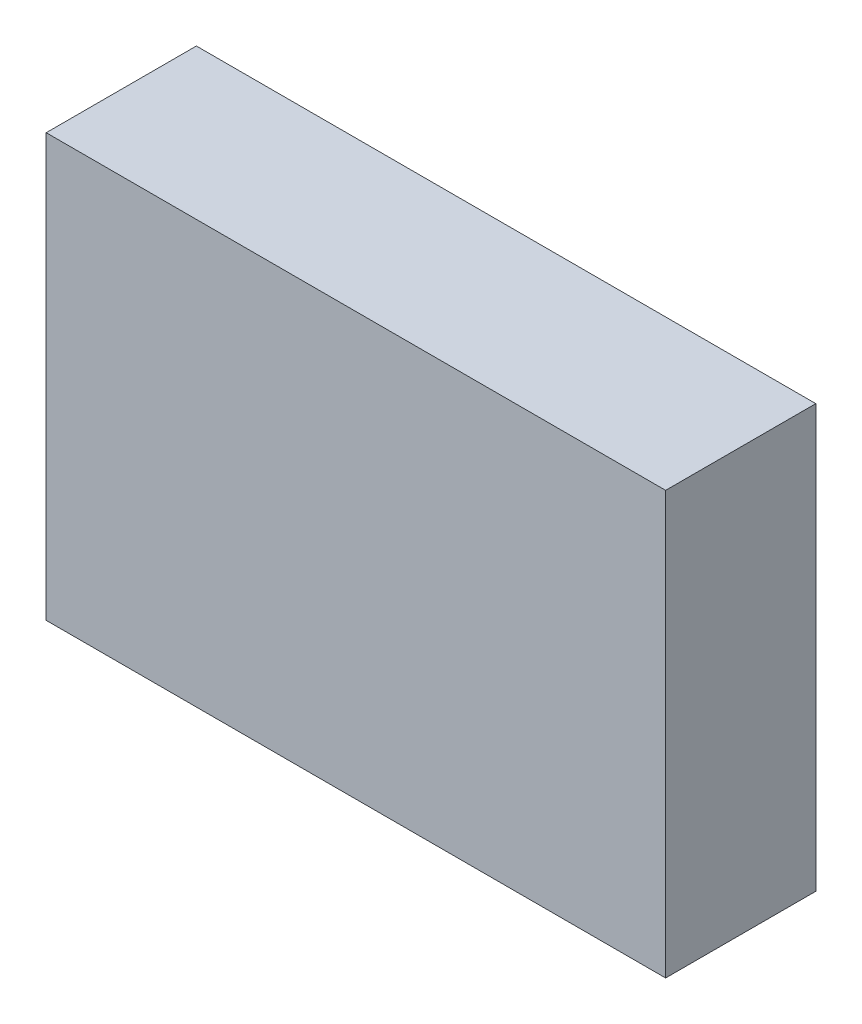
ISO-10303-21;
HEADER;
FILE_DESCRIPTION(('STEP AP214'),'2;1');
FILE_NAME('part.step','',(''),(''),'','','');
FILE_SCHEMA(('AUTOMOTIVE_DESIGN { 1 0 10303 214 1 1 1 1 }'));
ENDSEC;
DATA;
#1=APPLICATION_CONTEXT('core data for automotive mechanical design processes');
#2=APPLICATION_PROTOCOL_DEFINITION('international standard','automotive_design',2000,#1);
#3=PRODUCT_CONTEXT('',#1,'mechanical');
#4=PRODUCT('Part','Part','',(#3));
#5=PRODUCT_RELATED_PRODUCT_CATEGORY('part','',(#4));
#6=PRODUCT_DEFINITION_FORMATION('','',#4);
#7=PRODUCT_DEFINITION_CONTEXT('part definition',#1,'design');
#8=PRODUCT_DEFINITION('design','',#6,#7);
#9=PRODUCT_DEFINITION_SHAPE('','',#8);
#10=(LENGTH_UNIT() NAMED_UNIT(*) SI_UNIT(.MILLI.,.METRE.));
#11=(NAMED_UNIT(*) PLANE_ANGLE_UNIT() SI_UNIT($,.RADIAN.));
#12=(NAMED_UNIT(*) SI_UNIT($,.STERADIAN.) SOLID_ANGLE_UNIT());
#13=UNCERTAINTY_MEASURE_WITH_UNIT(LENGTH_MEASURE(1.E-05),#10,'distance_accuracy_value','');
#14=(GEOMETRIC_REPRESENTATION_CONTEXT(3) GLOBAL_UNCERTAINTY_ASSIGNED_CONTEXT((#13)) GLOBAL_UNIT_ASSIGNED_CONTEXT((#10,
#11,#12)) REPRESENTATION_CONTEXT('',''));
#15=CARTESIAN_POINT('',(0.,0.,0.));
#16=DIRECTION('',(0.,0.,1.));
#17=DIRECTION('',(1.,0.,0.));
#18=AXIS2_PLACEMENT_3D('',#15,#16,#17);
#19=CARTESIAN_POINT('',(0.06,0.,0.06));
#20=DIRECTION('',(1.,0.,0.));
#21=DIRECTION('',(0.,0.,1.));
#22=AXIS2_PLACEMENT_3D('',#19,#20,#21);
#23=PLANE('',#22);
#24=DIRECTION('',(0.,1.,0.));
#25=VECTOR('',#24,1.);
#26=CARTESIAN_POINT('',(0.06,0.,0.54));
#27=LINE('',#26,#25);
#28=CARTESIAN_POINT('',(0.06,0.,0.54));
#29=VERTEX_POINT('',#28);
#30=CARTESIAN_POINT('',(0.06,1.35,0.54));
#31=VERTEX_POINT('',#30);
#32=EDGE_CURVE('E11',#29,#31,#27,.T.);
#33=ORIENTED_EDGE('',*,*,#32,.T.);
#34=DIRECTION('',(0.,0.,1.));
#35=VECTOR('',#34,1.);
#36=CARTESIAN_POINT('',(0.06,1.35,0.06));
#37=LINE('',#36,#35);
#38=CARTESIAN_POINT('',(0.06,1.35,0.06));
#39=VERTEX_POINT('',#38);
#40=EDGE_CURVE('E69',#39,#31,#37,.T.);
#41=ORIENTED_EDGE('',*,*,#40,.F.);
#42=DIRECTION('',(0.,1.,0.));
#43=VECTOR('',#42,1.);
#44=CARTESIAN_POINT('',(0.06,0.,0.06));
#45=LINE('',#44,#43);
#46=CARTESIAN_POINT('',(0.06,0.,0.06));
#47=VERTEX_POINT('',#46);
#48=EDGE_CURVE('E81',#47,#39,#45,.T.);
#49=ORIENTED_EDGE('',*,*,#48,.F.);
#50=DIRECTION('',(0.,0.,1.));
#51=VECTOR('',#50,1.);
#52=CARTESIAN_POINT('',(0.06,0.,0.06));
#53=LINE('',#52,#51);
#54=EDGE_CURVE('E64',#47,#29,#53,.T.);
#55=ORIENTED_EDGE('',*,*,#54,.T.);
#56=EDGE_LOOP('',(#33,#41,#49,#55));
#57=FACE_BOUND('',#56,.T.);
#58=ADVANCED_FACE('F17',(#57),#23,.F.);
#59=CARTESIAN_POINT('',(2.04,0.,0.06));
#60=DIRECTION('',(1.,0.,0.));
#61=DIRECTION('',(0.,0.,1.));
#62=AXIS2_PLACEMENT_3D('',#59,#60,#61);
#63=PLANE('',#62);
#64=DIRECTION('',(0.,0.,1.));
#65=VECTOR('',#64,1.);
#66=CARTESIAN_POINT('',(2.04,0.,0.06));
#67=LINE('',#66,#65);
#68=CARTESIAN_POINT('',(2.04,0.,0.06));
#69=VERTEX_POINT('',#68);
#70=CARTESIAN_POINT('',(2.04,0.,0.54));
#71=VERTEX_POINT('',#70);
#72=EDGE_CURVE('E24',#69,#71,#67,.T.);
#73=ORIENTED_EDGE('',*,*,#72,.F.);
#74=DIRECTION('',(0.,1.,0.));
#75=VECTOR('',#74,1.);
#76=CARTESIAN_POINT('',(2.04,0.,0.06));
#77=LINE('',#76,#75);
#78=CARTESIAN_POINT('',(2.04,1.35,0.06));
#79=VERTEX_POINT('',#78);
#80=EDGE_CURVE('E59',#69,#79,#77,.T.);
#81=ORIENTED_EDGE('',*,*,#80,.T.);
#82=DIRECTION('',(0.,0.,1.));
#83=VECTOR('',#82,1.);
#84=CARTESIAN_POINT('',(2.04,1.35,0.06));
#85=LINE('',#84,#83);
#86=CARTESIAN_POINT('',(2.04,1.35,0.54));
#87=VERTEX_POINT('',#86);
#88=EDGE_CURVE('E53',#79,#87,#85,.T.);
#89=ORIENTED_EDGE('',*,*,#88,.T.);
#90=DIRECTION('',(0.,1.,0.));
#91=VECTOR('',#90,1.);
#92=CARTESIAN_POINT('',(2.04,0.,0.54));
#93=LINE('',#92,#91);
#94=EDGE_CURVE('E57',#71,#87,#93,.T.);
#95=ORIENTED_EDGE('',*,*,#94,.F.);
#96=EDGE_LOOP('',(#73,#81,#89,#95));
#97=FACE_BOUND('',#96,.T.);
#98=ADVANCED_FACE('F55',(#97),#63,.T.);
#99=CARTESIAN_POINT('',(0.06,0.,0.06));
#100=DIRECTION('',(0.,1.,0.));
#101=DIRECTION('',(0.,0.,1.));
#102=AXIS2_PLACEMENT_3D('',#99,#100,#101);
#103=PLANE('',#102);
#104=ORIENTED_EDGE('',*,*,#72,.T.);
#105=DIRECTION('',(1.,0.,0.));
#106=VECTOR('',#105,1.);
#107=CARTESIAN_POINT('',(0.06,0.,0.54));
#108=LINE('',#107,#106);
#109=EDGE_CURVE('E63',#29,#71,#108,.T.);
#110=ORIENTED_EDGE('',*,*,#109,.F.);
#111=ORIENTED_EDGE('',*,*,#54,.F.);
#112=DIRECTION('',(1.,0.,0.));
#113=VECTOR('',#112,1.);
#114=CARTESIAN_POINT('',(0.06,0.,0.06));
#115=LINE('',#114,#113);
#116=EDGE_CURVE('E71',#47,#69,#115,.T.);
#117=ORIENTED_EDGE('',*,*,#116,.T.);
#118=EDGE_LOOP('',(#104,#110,#111,#117));
#119=FACE_BOUND('',#118,.T.);
#120=ADVANCED_FACE('F87',(#119),#103,.F.);
#121=CARTESIAN_POINT('',(0.06,1.35,0.06));
#122=DIRECTION('',(0.,1.,0.));
#123=DIRECTION('',(0.,0.,1.));
#124=AXIS2_PLACEMENT_3D('',#121,#122,#123);
#125=PLANE('',#124);
#126=DIRECTION('',(1.,0.,0.));
#127=VECTOR('',#126,1.);
#128=CARTESIAN_POINT('',(0.06,1.35,0.06));
#129=LINE('',#128,#127);
#130=EDGE_CURVE('E79',#39,#79,#129,.T.);
#131=ORIENTED_EDGE('',*,*,#130,.F.);
#132=ORIENTED_EDGE('',*,*,#40,.T.);
#133=DIRECTION('',(1.,0.,0.));
#134=VECTOR('',#133,1.);
#135=CARTESIAN_POINT('',(0.06,1.35,0.54));
#136=LINE('',#135,#134);
#137=EDGE_CURVE('E67',#31,#87,#136,.T.);
#138=ORIENTED_EDGE('',*,*,#137,.T.);
#139=ORIENTED_EDGE('',*,*,#88,.F.);
#140=EDGE_LOOP('',(#131,#132,#138,#139));
#141=FACE_BOUND('',#140,.T.);
#142=ADVANCED_FACE('F68',(#141),#125,.T.);
#143=CARTESIAN_POINT('',(0.06,0.,0.06));
#144=DIRECTION('',(0.,0.,1.));
#145=DIRECTION('',(1.,0.,0.));
#146=AXIS2_PLACEMENT_3D('',#143,#144,#145);
#147=PLANE('',#146);
#148=ORIENTED_EDGE('',*,*,#130,.T.);
#149=ORIENTED_EDGE('',*,*,#80,.F.);
#150=ORIENTED_EDGE('',*,*,#116,.F.);
#151=ORIENTED_EDGE('',*,*,#48,.T.);
#152=EDGE_LOOP('',(#148,#149,#150,#151));
#153=FACE_BOUND('',#152,.T.);
#154=ADVANCED_FACE('F91',(#153),#147,.F.);
#155=CARTESIAN_POINT('',(0.06,0.,0.54));
#156=DIRECTION('',(0.,0.,1.));
#157=DIRECTION('',(1.,0.,0.));
#158=AXIS2_PLACEMENT_3D('',#155,#156,#157);
#159=PLANE('',#158);
#160=ORIENTED_EDGE('',*,*,#32,.F.);
#161=ORIENTED_EDGE('',*,*,#109,.T.);
#162=ORIENTED_EDGE('',*,*,#94,.T.);
#163=ORIENTED_EDGE('',*,*,#137,.F.);
#164=EDGE_LOOP('',(#160,#161,#162,#163));
#165=FACE_BOUND('',#164,.T.);
#166=ADVANCED_FACE('F73',(#165),#159,.T.);
#167=CLOSED_SHELL('',(#58,#98,#120,#142,#154,#166));
#168=MANIFOLD_SOLID_BREP('B1',#167);
#169=ADVANCED_BREP_SHAPE_REPRESENTATION('',(#18,#168),#14);
#170=SHAPE_DEFINITION_REPRESENTATION(#9,#169);
ENDSEC;
END-ISO-10303-21;
